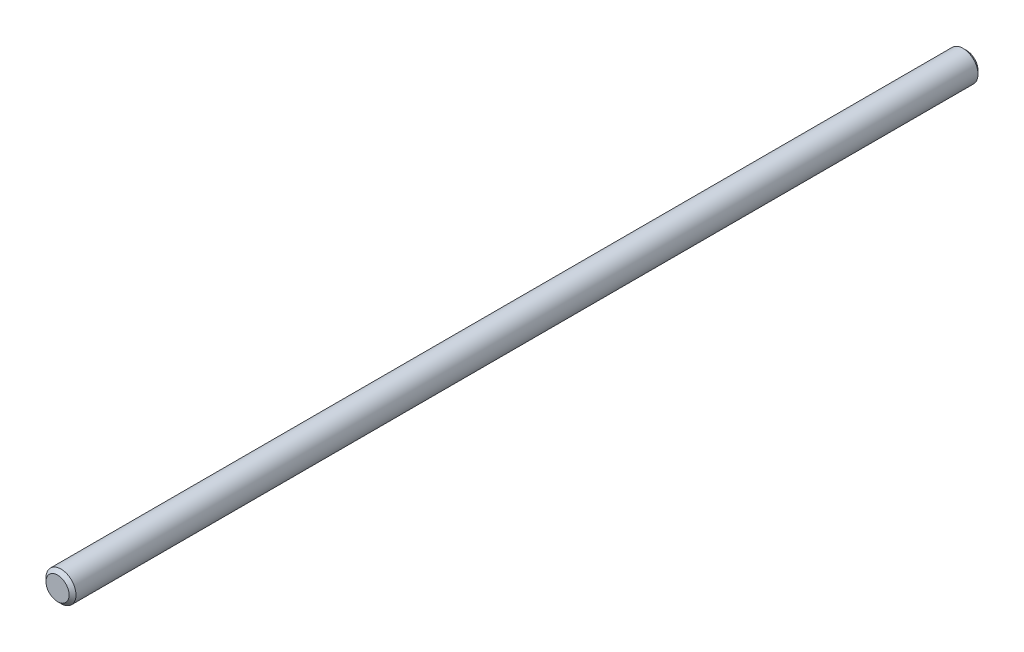
ISO-10303-21;
HEADER;
FILE_DESCRIPTION(('STEP AP214'),'2;1');
FILE_NAME('part.step','',(''),(''),'','','');
FILE_SCHEMA(('AUTOMOTIVE_DESIGN { 1 0 10303 214 1 1 1 1 }'));
ENDSEC;
DATA;
#1=APPLICATION_CONTEXT('core data for automotive mechanical design processes');
#2=APPLICATION_PROTOCOL_DEFINITION('international standard','automotive_design',2000,#1);
#3=PRODUCT_CONTEXT('',#1,'mechanical');
#4=PRODUCT('Part','Part','',(#3));
#5=PRODUCT_RELATED_PRODUCT_CATEGORY('part','',(#4));
#6=PRODUCT_DEFINITION_FORMATION('','',#4);
#7=PRODUCT_DEFINITION_CONTEXT('part definition',#1,'design');
#8=PRODUCT_DEFINITION('design','',#6,#7);
#9=PRODUCT_DEFINITION_SHAPE('','',#8);
#10=(LENGTH_UNIT() NAMED_UNIT(*) SI_UNIT(.MILLI.,.METRE.));
#11=(NAMED_UNIT(*) PLANE_ANGLE_UNIT() SI_UNIT($,.RADIAN.));
#12=(NAMED_UNIT(*) SI_UNIT($,.STERADIAN.) SOLID_ANGLE_UNIT());
#13=UNCERTAINTY_MEASURE_WITH_UNIT(LENGTH_MEASURE(1.E-05),#10,'distance_accuracy_value','');
#14=(GEOMETRIC_REPRESENTATION_CONTEXT(3) GLOBAL_UNCERTAINTY_ASSIGNED_CONTEXT((#13)) GLOBAL_UNIT_ASSIGNED_CONTEXT((#10,
#11,#12)) REPRESENTATION_CONTEXT('',''));
#15=CARTESIAN_POINT('',(0.,0.,0.));
#16=DIRECTION('',(0.,0.,1.));
#17=DIRECTION('',(1.,0.,0.));
#18=AXIS2_PLACEMENT_3D('',#15,#16,#17);
#19=CARTESIAN_POINT('',(0.,0.,787.5));
#20=DIRECTION('',(0.,0.,-1.));
#21=DIRECTION('',(-1.,0.,0.));
#22=AXIS2_PLACEMENT_3D('',#19,#20,#21);
#23=CYLINDRICAL_SURFACE('',#22,13.);
#24=CARTESIAN_POINT('',(0.,0.,3.00000000000045));
#25=DIRECTION('',(0.,0.,1.));
#26=DIRECTION('',(1.,0.,0.));
#27=AXIS2_PLACEMENT_3D('',#24,#25,#26);
#28=CIRCLE('',#27,13.);
#29=CARTESIAN_POINT('',(13.,0.,3.00000000000045));
#30=VERTEX_POINT('',#29);
#31=EDGE_CURVE('E51',#30,#30,#28,.T.);
#32=ORIENTED_EDGE('',*,*,#31,.T.);
#33=EDGE_LOOP('',(#32));
#34=FACE_BOUND('',#33,.T.);
#35=CARTESIAN_POINT('',(0.,0.,784.5));
#36=DIRECTION('',(0.,0.,1.));
#37=DIRECTION('',(1.,0.,0.));
#38=AXIS2_PLACEMENT_3D('',#35,#36,#37);
#39=CIRCLE('',#38,13.);
#40=CARTESIAN_POINT('',(13.,0.,784.5));
#41=VERTEX_POINT('',#40);
#42=EDGE_CURVE('E55',#41,#41,#39,.F.);
#43=ORIENTED_EDGE('',*,*,#42,.T.);
#44=EDGE_LOOP('',(#43));
#45=FACE_BOUND('',#44,.T.);
#46=ADVANCED_FACE('F39',(#34,#45),#23,.T.);
#47=CARTESIAN_POINT('',(0.,0.,787.5));
#48=DIRECTION('',(0.,0.,1.));
#49=DIRECTION('',(1.,0.,0.));
#50=AXIS2_PLACEMENT_3D('',#47,#48,#49);
#51=PLANE('',#50);
#52=CARTESIAN_POINT('',(0.,0.,787.5));
#53=DIRECTION('',(0.,0.,1.));
#54=DIRECTION('',(1.,0.,0.));
#55=AXIS2_PLACEMENT_3D('',#52,#53,#54);
#56=CIRCLE('',#55,10.0000000000003);
#57=CARTESIAN_POINT('',(10.0000000000003,0.,787.5));
#58=VERTEX_POINT('',#57);
#59=EDGE_CURVE('E10',#58,#58,#56,.T.);
#60=ORIENTED_EDGE('',*,*,#59,.T.);
#61=EDGE_LOOP('',(#60));
#62=FACE_BOUND('',#61,.T.);
#63=ADVANCED_FACE('F71',(#62),#51,.T.);
#64=CARTESIAN_POINT('',(0.,0.,0.));
#65=DIRECTION('',(0.,0.,1.));
#66=DIRECTION('',(1.,0.,0.));
#67=AXIS2_PLACEMENT_3D('',#64,#65,#66);
#68=PLANE('',#67);
#69=CARTESIAN_POINT('',(0.,0.,0.));
#70=DIRECTION('',(0.,0.,1.));
#71=DIRECTION('',(1.,0.,0.));
#72=AXIS2_PLACEMENT_3D('',#69,#70,#71);
#73=CIRCLE('',#72,9.99999999999945);
#74=CARTESIAN_POINT('',(9.99999999999945,0.,0.));
#75=VERTEX_POINT('',#74);
#76=EDGE_CURVE('E47',#75,#75,#73,.F.);
#77=ORIENTED_EDGE('',*,*,#76,.T.);
#78=EDGE_LOOP('',(#77));
#79=FACE_BOUND('',#78,.T.);
#80=ADVANCED_FACE('F68',(#79),#68,.F.);
#81=CARTESIAN_POINT('',(0.,0.,3.00000000000045));
#82=DIRECTION('',(0.,0.,1.));
#83=DIRECTION('',(1.,0.,0.));
#84=AXIS2_PLACEMENT_3D('',#81,#82,#83);
#85=CONICAL_SURFACE('',#84,13.,0.785398163397465);
#86=ORIENTED_EDGE('',*,*,#76,.F.);
#87=EDGE_LOOP('',(#86));
#88=FACE_BOUND('',#87,.T.);
#89=ORIENTED_EDGE('',*,*,#31,.F.);
#90=EDGE_LOOP('',(#89));
#91=FACE_BOUND('',#90,.T.);
#92=ADVANCED_FACE('F64',(#88,#91),#85,.T.);
#93=CARTESIAN_POINT('',(0.,0.,787.5));
#94=DIRECTION('',(0.,0.,-1.));
#95=DIRECTION('',(-1.,0.,0.));
#96=AXIS2_PLACEMENT_3D('',#93,#94,#95);
#97=CONICAL_SURFACE('',#96,10.0000000000003,0.785398163397465);
#98=ORIENTED_EDGE('',*,*,#42,.F.);
#99=EDGE_LOOP('',(#98));
#100=FACE_BOUND('',#99,.T.);
#101=ORIENTED_EDGE('',*,*,#59,.F.);
#102=EDGE_LOOP('',(#101));
#103=FACE_BOUND('',#102,.T.);
#104=ADVANCED_FACE('F42',(#100,#103),#97,.T.);
#105=CLOSED_SHELL('',(#46,#63,#80,#92,#104));
#106=MANIFOLD_SOLID_BREP('B2',#105);
#107=ADVANCED_BREP_SHAPE_REPRESENTATION('',(#18,#106),#14);
#108=SHAPE_DEFINITION_REPRESENTATION(#9,#107);
ENDSEC;
END-ISO-10303-21;
